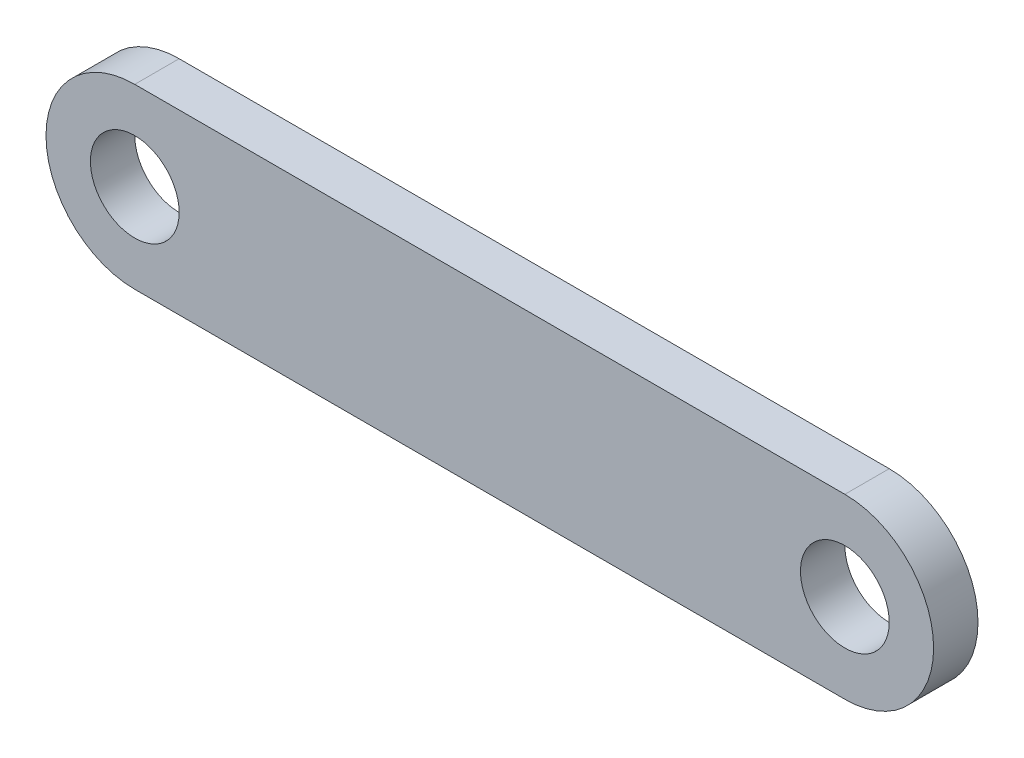
ISO-10303-21;
HEADER;
FILE_DESCRIPTION(('STEP AP214'),'2;1');
FILE_NAME('part.step','',(''),(''),'','','');
FILE_SCHEMA(('AUTOMOTIVE_DESIGN { 1 0 10303 214 1 1 1 1 }'));
ENDSEC;
DATA;
#1=APPLICATION_CONTEXT('core data for automotive mechanical design processes');
#2=APPLICATION_PROTOCOL_DEFINITION('international standard','automotive_design',2000,#1);
#3=PRODUCT_CONTEXT('',#1,'mechanical');
#4=PRODUCT('Part','Part','',(#3));
#5=PRODUCT_RELATED_PRODUCT_CATEGORY('part','',(#4));
#6=PRODUCT_DEFINITION_FORMATION('','',#4);
#7=PRODUCT_DEFINITION_CONTEXT('part definition',#1,'design');
#8=PRODUCT_DEFINITION('design','',#6,#7);
#9=PRODUCT_DEFINITION_SHAPE('','',#8);
#10=(LENGTH_UNIT() NAMED_UNIT(*) SI_UNIT(.MILLI.,.METRE.));
#11=(NAMED_UNIT(*) PLANE_ANGLE_UNIT() SI_UNIT($,.RADIAN.));
#12=(NAMED_UNIT(*) SI_UNIT($,.STERADIAN.) SOLID_ANGLE_UNIT());
#13=UNCERTAINTY_MEASURE_WITH_UNIT(LENGTH_MEASURE(1.E-05),#10,'distance_accuracy_value','');
#14=(GEOMETRIC_REPRESENTATION_CONTEXT(3) GLOBAL_UNCERTAINTY_ASSIGNED_CONTEXT((#13)) GLOBAL_UNIT_ASSIGNED_CONTEXT((#10,
#11,#12)) REPRESENTATION_CONTEXT('',''));
#15=CARTESIAN_POINT('',(0.,0.,0.));
#16=DIRECTION('',(0.,0.,1.));
#17=DIRECTION('',(1.,0.,0.));
#18=AXIS2_PLACEMENT_3D('',#15,#16,#17);
#19=CARTESIAN_POINT('',(-25.4,0.,3.175));
#20=DIRECTION('',(0.,0.,1.));
#21=DIRECTION('',(1.,0.,0.));
#22=AXIS2_PLACEMENT_3D('',#19,#20,#21);
#23=PLANE('',#22);
#24=CARTESIAN_POINT('',(-25.4,0.,3.175));
#25=DIRECTION('',(0.,0.,1.));
#26=DIRECTION('',(1.,0.,0.));
#27=AXIS2_PLACEMENT_3D('',#24,#25,#26);
#28=CIRCLE('',#27,3.17499999999997);
#29=CARTESIAN_POINT('',(-22.225,0.,3.175));
#30=VERTEX_POINT('',#29);
#31=EDGE_CURVE('E129',#30,#30,#28,.T.);
#32=ORIENTED_EDGE('',*,*,#31,.F.);
#33=EDGE_LOOP('',(#32));
#34=FACE_BOUND('',#33,.T.);
#35=CARTESIAN_POINT('',(-25.4,0.,3.175));
#36=DIRECTION('',(0.,0.,1.));
#37=DIRECTION('',(1.,0.,0.));
#38=AXIS2_PLACEMENT_3D('',#35,#36,#37);
#39=CIRCLE('',#38,6.35);
#40=CARTESIAN_POINT('',(-25.4,6.35,3.175));
#41=VERTEX_POINT('',#40);
#42=CARTESIAN_POINT('',(-25.4,-6.35,3.175));
#43=VERTEX_POINT('',#42);
#44=EDGE_CURVE('E113',#41,#43,#39,.T.);
#45=ORIENTED_EDGE('',*,*,#44,.T.);
#46=DIRECTION('',(1.,0.,0.));
#47=VECTOR('',#46,1.);
#48=CARTESIAN_POINT('',(-25.4,-6.35,3.175));
#49=LINE('',#48,#47);
#50=CARTESIAN_POINT('',(25.4,-6.35,3.175));
#51=VERTEX_POINT('',#50);
#52=EDGE_CURVE('E106',#43,#51,#49,.T.);
#53=ORIENTED_EDGE('',*,*,#52,.T.);
#54=CARTESIAN_POINT('',(25.4,0.,3.175));
#55=DIRECTION('',(0.,0.,1.));
#56=DIRECTION('',(1.,0.,0.));
#57=AXIS2_PLACEMENT_3D('',#54,#55,#56);
#58=CIRCLE('',#57,6.35);
#59=CARTESIAN_POINT('',(25.4,6.35,3.175));
#60=VERTEX_POINT('',#59);
#61=EDGE_CURVE('E112',#51,#60,#58,.T.);
#62=ORIENTED_EDGE('',*,*,#61,.T.);
#63=DIRECTION('',(1.,0.,0.));
#64=VECTOR('',#63,1.);
#65=CARTESIAN_POINT('',(-25.4,6.35,3.175));
#66=LINE('',#65,#64);
#67=EDGE_CURVE('E122',#41,#60,#66,.T.);
#68=ORIENTED_EDGE('',*,*,#67,.F.);
#69=EDGE_LOOP('',(#45,#53,#62,#68));
#70=FACE_BOUND('',#69,.T.);
#71=CARTESIAN_POINT('',(25.4,0.,3.175));
#72=DIRECTION('',(0.,0.,1.));
#73=DIRECTION('',(1.,0.,0.));
#74=AXIS2_PLACEMENT_3D('',#71,#72,#73);
#75=CIRCLE('',#74,3.17499999999997);
#76=CARTESIAN_POINT('',(28.575,0.,3.175));
#77=VERTEX_POINT('',#76);
#78=EDGE_CURVE('E142',#77,#77,#75,.T.);
#79=ORIENTED_EDGE('',*,*,#78,.F.);
#80=EDGE_LOOP('',(#79));
#81=FACE_BOUND('',#80,.T.);
#82=ADVANCED_FACE('F63',(#34,#70,#81),#23,.T.);
#83=CARTESIAN_POINT('',(-25.4,0.,0.));
#84=DIRECTION('',(0.,0.,1.));
#85=DIRECTION('',(1.,0.,0.));
#86=AXIS2_PLACEMENT_3D('',#83,#84,#85);
#87=PLANE('',#86);
#88=CARTESIAN_POINT('',(-25.4,0.,0.));
#89=DIRECTION('',(0.,0.,1.));
#90=DIRECTION('',(1.,0.,0.));
#91=AXIS2_PLACEMENT_3D('',#88,#89,#90);
#92=CIRCLE('',#91,6.35);
#93=CARTESIAN_POINT('',(-25.4,6.35,0.));
#94=VERTEX_POINT('',#93);
#95=CARTESIAN_POINT('',(-25.4,-6.35,0.));
#96=VERTEX_POINT('',#95);
#97=EDGE_CURVE('E127',#94,#96,#92,.T.);
#98=ORIENTED_EDGE('',*,*,#97,.F.);
#99=DIRECTION('',(1.,0.,0.));
#100=VECTOR('',#99,1.);
#101=CARTESIAN_POINT('',(-25.4,6.35,0.));
#102=LINE('',#101,#100);
#103=CARTESIAN_POINT('',(25.4,6.35,0.));
#104=VERTEX_POINT('',#103);
#105=EDGE_CURVE('E133',#94,#104,#102,.T.);
#106=ORIENTED_EDGE('',*,*,#105,.T.);
#107=CARTESIAN_POINT('',(25.4,0.,0.));
#108=DIRECTION('',(0.,0.,1.));
#109=DIRECTION('',(1.,0.,0.));
#110=AXIS2_PLACEMENT_3D('',#107,#108,#109);
#111=CIRCLE('',#110,6.35);
#112=CARTESIAN_POINT('',(25.4,-6.35,0.));
#113=VERTEX_POINT('',#112);
#114=EDGE_CURVE('E131',#113,#104,#111,.T.);
#115=ORIENTED_EDGE('',*,*,#114,.F.);
#116=DIRECTION('',(1.,0.,0.));
#117=VECTOR('',#116,1.);
#118=CARTESIAN_POINT('',(-25.4,-6.35,0.));
#119=LINE('',#118,#117);
#120=EDGE_CURVE('E118',#96,#113,#119,.T.);
#121=ORIENTED_EDGE('',*,*,#120,.F.);
#122=EDGE_LOOP('',(#98,#106,#115,#121));
#123=FACE_BOUND('',#122,.T.);
#124=CARTESIAN_POINT('',(-25.4,0.,0.));
#125=DIRECTION('',(0.,0.,1.));
#126=DIRECTION('',(1.,0.,0.));
#127=AXIS2_PLACEMENT_3D('',#124,#125,#126);
#128=CIRCLE('',#127,3.17499999999997);
#129=CARTESIAN_POINT('',(-22.225,0.,0.));
#130=VERTEX_POINT('',#129);
#131=EDGE_CURVE('E139',#130,#130,#128,.T.);
#132=ORIENTED_EDGE('',*,*,#131,.T.);
#133=EDGE_LOOP('',(#132));
#134=FACE_BOUND('',#133,.T.);
#135=CARTESIAN_POINT('',(25.4,0.,0.));
#136=DIRECTION('',(0.,0.,1.));
#137=DIRECTION('',(1.,0.,0.));
#138=AXIS2_PLACEMENT_3D('',#135,#136,#137);
#139=CIRCLE('',#138,3.17499999999997);
#140=CARTESIAN_POINT('',(28.575,0.,0.));
#141=VERTEX_POINT('',#140);
#142=EDGE_CURVE('E145',#141,#141,#139,.T.);
#143=ORIENTED_EDGE('',*,*,#142,.T.);
#144=EDGE_LOOP('',(#143));
#145=FACE_BOUND('',#144,.T.);
#146=ADVANCED_FACE('F154',(#123,#134,#145),#87,.F.);
#147=CARTESIAN_POINT('',(-25.4,0.,3.175));
#148=DIRECTION('',(0.,0.,-1.));
#149=DIRECTION('',(-1.,0.,0.));
#150=AXIS2_PLACEMENT_3D('',#147,#148,#149);
#151=CYLINDRICAL_SURFACE('',#150,6.35);
#152=ORIENTED_EDGE('',*,*,#97,.T.);
#153=DIRECTION('',(0.,0.,-1.));
#154=VECTOR('',#153,1.);
#155=CARTESIAN_POINT('',(-25.4,-6.35,3.175));
#156=LINE('',#155,#154);
#157=EDGE_CURVE('E12',#43,#96,#156,.T.);
#158=ORIENTED_EDGE('',*,*,#157,.F.);
#159=ORIENTED_EDGE('',*,*,#44,.F.);
#160=DIRECTION('',(0.,0.,-1.));
#161=VECTOR('',#160,1.);
#162=CARTESIAN_POINT('',(-25.4,6.35,3.175));
#163=LINE('',#162,#161);
#164=EDGE_CURVE('E80',#41,#94,#163,.T.);
#165=ORIENTED_EDGE('',*,*,#164,.T.);
#166=EDGE_LOOP('',(#152,#158,#159,#165));
#167=FACE_BOUND('',#166,.T.);
#168=ADVANCED_FACE('F65',(#167),#151,.T.);
#169=CARTESIAN_POINT('',(-25.4,-6.35,3.175));
#170=DIRECTION('',(0.,1.,0.));
#171=DIRECTION('',(0.,0.,1.));
#172=AXIS2_PLACEMENT_3D('',#169,#170,#171);
#173=PLANE('',#172);
#174=ORIENTED_EDGE('',*,*,#120,.T.);
#175=DIRECTION('',(0.,0.,-1.));
#176=VECTOR('',#175,1.);
#177=CARTESIAN_POINT('',(25.4,-6.35,3.175));
#178=LINE('',#177,#176);
#179=EDGE_CURVE('E72',#51,#113,#178,.T.);
#180=ORIENTED_EDGE('',*,*,#179,.F.);
#181=ORIENTED_EDGE('',*,*,#52,.F.);
#182=ORIENTED_EDGE('',*,*,#157,.T.);
#183=EDGE_LOOP('',(#174,#180,#181,#182));
#184=FACE_BOUND('',#183,.T.);
#185=ADVANCED_FACE('F117',(#184),#173,.F.);
#186=CARTESIAN_POINT('',(25.4,0.,3.175));
#187=DIRECTION('',(0.,0.,-1.));
#188=DIRECTION('',(-1.,0.,0.));
#189=AXIS2_PLACEMENT_3D('',#186,#187,#188);
#190=CYLINDRICAL_SURFACE('',#189,6.35);
#191=ORIENTED_EDGE('',*,*,#114,.T.);
#192=DIRECTION('',(0.,0.,-1.));
#193=VECTOR('',#192,1.);
#194=CARTESIAN_POINT('',(25.4,6.35,3.175));
#195=LINE('',#194,#193);
#196=EDGE_CURVE('E95',#60,#104,#195,.T.);
#197=ORIENTED_EDGE('',*,*,#196,.F.);
#198=ORIENTED_EDGE('',*,*,#61,.F.);
#199=ORIENTED_EDGE('',*,*,#179,.T.);
#200=EDGE_LOOP('',(#191,#197,#198,#199));
#201=FACE_BOUND('',#200,.T.);
#202=ADVANCED_FACE('F121',(#201),#190,.T.);
#203=CARTESIAN_POINT('',(-25.4,6.35,3.175));
#204=DIRECTION('',(0.,1.,0.));
#205=DIRECTION('',(0.,0.,1.));
#206=AXIS2_PLACEMENT_3D('',#203,#204,#205);
#207=PLANE('',#206);
#208=ORIENTED_EDGE('',*,*,#105,.F.);
#209=ORIENTED_EDGE('',*,*,#164,.F.);
#210=ORIENTED_EDGE('',*,*,#67,.T.);
#211=ORIENTED_EDGE('',*,*,#196,.T.);
#212=EDGE_LOOP('',(#208,#209,#210,#211));
#213=FACE_BOUND('',#212,.T.);
#214=ADVANCED_FACE('F166',(#213),#207,.T.);
#215=CARTESIAN_POINT('',(-25.4,0.,3.175));
#216=DIRECTION('',(0.,0.,-1.));
#217=DIRECTION('',(-1.,0.,0.));
#218=AXIS2_PLACEMENT_3D('',#215,#216,#217);
#219=CYLINDRICAL_SURFACE('',#218,3.17499999999997);
#220=ORIENTED_EDGE('',*,*,#31,.T.);
#221=EDGE_LOOP('',(#220));
#222=FACE_BOUND('',#221,.T.);
#223=ORIENTED_EDGE('',*,*,#131,.F.);
#224=EDGE_LOOP('',(#223));
#225=FACE_BOUND('',#224,.T.);
#226=ADVANCED_FACE('F163',(#222,#225),#219,.F.);
#227=CARTESIAN_POINT('',(25.4,0.,3.175));
#228=DIRECTION('',(0.,0.,-1.));
#229=DIRECTION('',(-1.,0.,0.));
#230=AXIS2_PLACEMENT_3D('',#227,#228,#229);
#231=CYLINDRICAL_SURFACE('',#230,3.17499999999997);
#232=ORIENTED_EDGE('',*,*,#78,.T.);
#233=EDGE_LOOP('',(#232));
#234=FACE_BOUND('',#233,.T.);
#235=ORIENTED_EDGE('',*,*,#142,.F.);
#236=EDGE_LOOP('',(#235));
#237=FACE_BOUND('',#236,.T.);
#238=ADVANCED_FACE('F151',(#234,#237),#231,.F.);
#239=CLOSED_SHELL('',(#82,#146,#168,#185,#202,#214,#226,#238));
#240=MANIFOLD_SOLID_BREP('B2',#239);
#241=ADVANCED_BREP_SHAPE_REPRESENTATION('',(#18,#240),#14);
#242=SHAPE_DEFINITION_REPRESENTATION(#9,#241);
ENDSEC;
END-ISO-10303-21;
